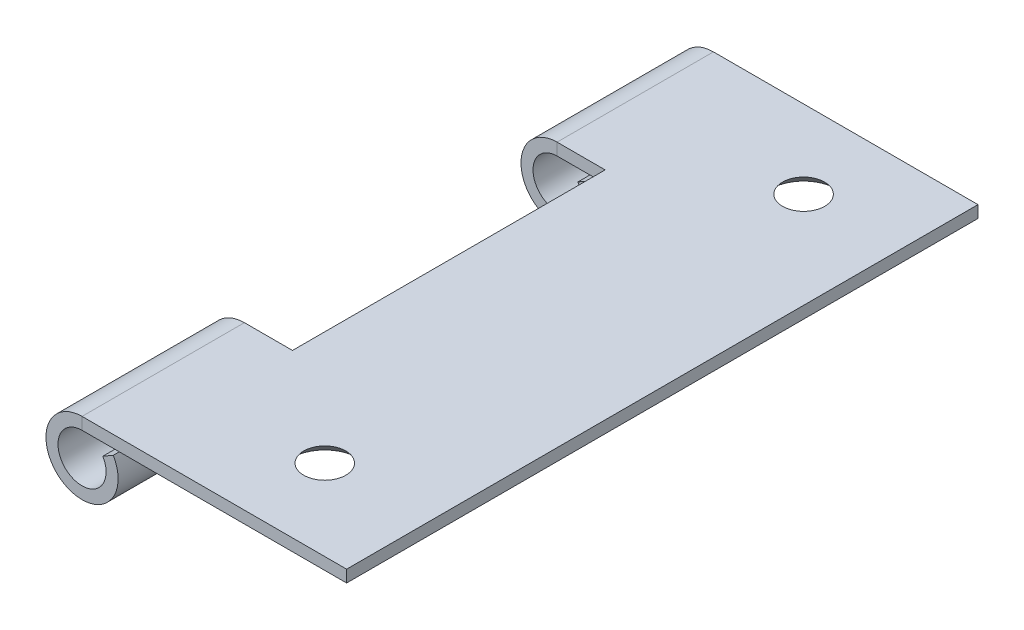
ISO-10303-21;
HEADER;
FILE_DESCRIPTION(('STEP AP214'),'2;1');
FILE_NAME('part.step','',(''),(''),'','','');
FILE_SCHEMA(('AUTOMOTIVE_DESIGN { 1 0 10303 214 1 1 1 1 }'));
ENDSEC;
DATA;
#1=APPLICATION_CONTEXT('core data for automotive mechanical design processes');
#2=APPLICATION_PROTOCOL_DEFINITION('international standard','automotive_design',2000,#1);
#3=PRODUCT_CONTEXT('',#1,'mechanical');
#4=PRODUCT('Part','Part','',(#3));
#5=PRODUCT_RELATED_PRODUCT_CATEGORY('part','',(#4));
#6=PRODUCT_DEFINITION_FORMATION('','',#4);
#7=PRODUCT_DEFINITION_CONTEXT('part definition',#1,'design');
#8=PRODUCT_DEFINITION('design','',#6,#7);
#9=PRODUCT_DEFINITION_SHAPE('','',#8);
#10=(LENGTH_UNIT() NAMED_UNIT(*) SI_UNIT(.MILLI.,.METRE.));
#11=(NAMED_UNIT(*) PLANE_ANGLE_UNIT() SI_UNIT($,.RADIAN.));
#12=(NAMED_UNIT(*) SI_UNIT($,.STERADIAN.) SOLID_ANGLE_UNIT());
#13=UNCERTAINTY_MEASURE_WITH_UNIT(LENGTH_MEASURE(1.E-05),#10,'distance_accuracy_value','');
#14=(GEOMETRIC_REPRESENTATION_CONTEXT(3) GLOBAL_UNCERTAINTY_ASSIGNED_CONTEXT((#13)) GLOBAL_UNIT_ASSIGNED_CONTEXT((#10,
#11,#12)) REPRESENTATION_CONTEXT('',''));
#15=CARTESIAN_POINT('',(0.,0.,0.));
#16=DIRECTION('',(0.,0.,1.));
#17=DIRECTION('',(1.,0.,0.));
#18=AXIS2_PLACEMENT_3D('',#15,#16,#17);
#19=CARTESIAN_POINT('',(19.,-1.,-0.272985055178714));
#20=DIRECTION('',(0.,0.,1.));
#21=DIRECTION('',(1.,0.,0.));
#22=AXIS2_PLACEMENT_3D('',#19,#20,#21);
#23=PLANE('',#22);
#24=DIRECTION('',(1.,0.,0.));
#25=VECTOR('',#24,1.);
#26=CARTESIAN_POINT('',(19.,0.,-0.272985055178714));
#27=LINE('',#26,#25);
#28=CARTESIAN_POINT('',(-3.,0.,-0.272985055178712));
#29=VERTEX_POINT('',#28);
#30=CARTESIAN_POINT('',(19.,0.,-0.272985055178714));
#31=VERTEX_POINT('',#30);
#32=EDGE_CURVE('E133',#29,#31,#27,.T.);
#33=ORIENTED_EDGE('',*,*,#32,.F.);
#34=DIRECTION('',(0.,1.,0.));
#35=VECTOR('',#34,1.);
#36=CARTESIAN_POINT('',(-3.,-1.,-0.272985055178711));
#37=LINE('',#36,#35);
#38=CARTESIAN_POINT('',(-3.,-1.,-0.272985055178711));
#39=VERTEX_POINT('',#38);
#40=EDGE_CURVE('E11',#39,#29,#37,.T.);
#41=ORIENTED_EDGE('',*,*,#40,.F.);
#42=DIRECTION('',(1.,0.,0.));
#43=VECTOR('',#42,1.);
#44=CARTESIAN_POINT('',(19.,-1.,-0.272985055178714));
#45=LINE('',#44,#43);
#46=CARTESIAN_POINT('',(19.,-1.,-0.272985055178714));
#47=VERTEX_POINT('',#46);
#48=EDGE_CURVE('E154',#39,#47,#45,.T.);
#49=ORIENTED_EDGE('',*,*,#48,.T.);
#50=DIRECTION('',(0.,1.,0.));
#51=VECTOR('',#50,1.);
#52=CARTESIAN_POINT('',(19.,-1.,-0.272985055178714));
#53=LINE('',#52,#51);
#54=EDGE_CURVE('E92',#47,#31,#53,.T.);
#55=ORIENTED_EDGE('',*,*,#54,.T.);
#56=EDGE_LOOP('',(#33,#41,#49,#55));
#57=FACE_BOUND('',#56,.T.);
#58=ADVANCED_FACE('F38',(#57),#23,.T.);
#59=CARTESIAN_POINT('',(1.00000000000001,-1.,-13.7729850551787));
#60=DIRECTION('',(0.,0.,-1.));
#61=DIRECTION('',(-1.,0.,0.));
#62=AXIS2_PLACEMENT_3D('',#59,#60,#61);
#63=PLANE('',#62);
#64=DIRECTION('',(-1.,0.,0.));
#65=VECTOR('',#64,1.);
#66=CARTESIAN_POINT('',(1.00000000000001,0.,-13.7729850551787));
#67=LINE('',#66,#65);
#68=CARTESIAN_POINT('',(1.00000000000001,0.,-13.7729850551787));
#69=VERTEX_POINT('',#68);
#70=CARTESIAN_POINT('',(-3.,0.,-13.7729850551787));
#71=VERTEX_POINT('',#70);
#72=EDGE_CURVE('E112',#69,#71,#67,.T.);
#73=ORIENTED_EDGE('',*,*,#72,.F.);
#74=DIRECTION('',(0.,1.,0.));
#75=VECTOR('',#74,1.);
#76=CARTESIAN_POINT('',(1.00000000000001,-1.,-13.7729850551787));
#77=LINE('',#76,#75);
#78=CARTESIAN_POINT('',(1.00000000000001,-1.,-13.7729850551787));
#79=VERTEX_POINT('',#78);
#80=EDGE_CURVE('E79',#79,#69,#77,.T.);
#81=ORIENTED_EDGE('',*,*,#80,.F.);
#82=DIRECTION('',(-1.,0.,0.));
#83=VECTOR('',#82,1.);
#84=CARTESIAN_POINT('',(1.00000000000001,-1.,-13.7729850551787));
#85=LINE('',#84,#83);
#86=CARTESIAN_POINT('',(-3.,-1.,-13.7729850551787));
#87=VERTEX_POINT('',#86);
#88=EDGE_CURVE('E110',#79,#87,#85,.T.);
#89=ORIENTED_EDGE('',*,*,#88,.T.);
#90=DIRECTION('',(0.,1.,0.));
#91=VECTOR('',#90,1.);
#92=CARTESIAN_POINT('',(-3.,-1.,-13.7729850551787));
#93=LINE('',#92,#91);
#94=EDGE_CURVE('E47',#87,#71,#93,.T.);
#95=ORIENTED_EDGE('',*,*,#94,.T.);
#96=EDGE_LOOP('',(#73,#81,#89,#95));
#97=FACE_BOUND('',#96,.T.);
#98=ADVANCED_FACE('F109',(#97),#63,.T.);
#99=CARTESIAN_POINT('',(1.,-1.,-39.7729850551787));
#100=DIRECTION('',(-1.,0.,0.));
#101=DIRECTION('',(0.,0.,1.));
#102=AXIS2_PLACEMENT_3D('',#99,#100,#101);
#103=PLANE('',#102);
#104=DIRECTION('',(0.,0.,1.));
#105=VECTOR('',#104,1.);
#106=CARTESIAN_POINT('',(1.,0.,-39.7729850551787));
#107=LINE('',#106,#105);
#108=CARTESIAN_POINT('',(1.,0.,-39.7729850551787));
#109=VERTEX_POINT('',#108);
#110=EDGE_CURVE('E149',#109,#69,#107,.T.);
#111=ORIENTED_EDGE('',*,*,#110,.F.);
#112=DIRECTION('',(0.,1.,0.));
#113=VECTOR('',#112,1.);
#114=CARTESIAN_POINT('',(1.,-1.,-39.7729850551787));
#115=LINE('',#114,#113);
#116=CARTESIAN_POINT('',(1.,-1.,-39.7729850551787));
#117=VERTEX_POINT('',#116);
#118=EDGE_CURVE('E114',#117,#109,#115,.T.);
#119=ORIENTED_EDGE('',*,*,#118,.F.);
#120=DIRECTION('',(0.,0.,1.));
#121=VECTOR('',#120,1.);
#122=CARTESIAN_POINT('',(1.,-1.,-39.7729850551787));
#123=LINE('',#122,#121);
#124=EDGE_CURVE('E120',#117,#79,#123,.T.);
#125=ORIENTED_EDGE('',*,*,#124,.T.);
#126=ORIENTED_EDGE('',*,*,#80,.T.);
#127=EDGE_LOOP('',(#111,#119,#125,#126));
#128=FACE_BOUND('',#127,.T.);
#129=ADVANCED_FACE('F125',(#128),#103,.T.);
#130=CARTESIAN_POINT('',(-3.,-1.,-39.7729850551787));
#131=DIRECTION('',(0.,0.,1.));
#132=DIRECTION('',(1.,0.,0.));
#133=AXIS2_PLACEMENT_3D('',#130,#131,#132);
#134=PLANE('',#133);
#135=DIRECTION('',(1.,0.,0.));
#136=VECTOR('',#135,1.);
#137=CARTESIAN_POINT('',(-3.,0.,-39.7729850551787));
#138=LINE('',#137,#136);
#139=CARTESIAN_POINT('',(-3.,0.,-39.7729850551787));
#140=VERTEX_POINT('',#139);
#141=EDGE_CURVE('E146',#140,#109,#138,.T.);
#142=ORIENTED_EDGE('',*,*,#141,.F.);
#143=DIRECTION('',(0.,1.,0.));
#144=VECTOR('',#143,1.);
#145=CARTESIAN_POINT('',(-3.,-1.,-39.7729850551787));
#146=LINE('',#145,#144);
#147=CARTESIAN_POINT('',(-3.,-1.,-39.7729850551787));
#148=VERTEX_POINT('',#147);
#149=EDGE_CURVE('E158',#148,#140,#146,.T.);
#150=ORIENTED_EDGE('',*,*,#149,.F.);
#151=DIRECTION('',(1.,0.,0.));
#152=VECTOR('',#151,1.);
#153=CARTESIAN_POINT('',(-3.,-1.,-39.7729850551787));
#154=LINE('',#153,#152);
#155=EDGE_CURVE('E126',#148,#117,#154,.T.);
#156=ORIENTED_EDGE('',*,*,#155,.T.);
#157=ORIENTED_EDGE('',*,*,#118,.T.);
#158=EDGE_LOOP('',(#142,#150,#156,#157));
#159=FACE_BOUND('',#158,.T.);
#160=ADVANCED_FACE('F311',(#159),#134,.T.);
#161=CARTESIAN_POINT('',(19.,-1.,-52.7729850551787));
#162=DIRECTION('',(0.,0.,-1.));
#163=DIRECTION('',(-1.,0.,0.));
#164=AXIS2_PLACEMENT_3D('',#161,#162,#163);
#165=PLANE('',#164);
#166=DIRECTION('',(-1.,0.,0.));
#167=VECTOR('',#166,1.);
#168=CARTESIAN_POINT('',(19.,0.,-52.7729850551787));
#169=LINE('',#168,#167);
#170=CARTESIAN_POINT('',(19.,0.,-52.7729850551787));
#171=VERTEX_POINT('',#170);
#172=CARTESIAN_POINT('',(-3.,0.,-52.7729850551787));
#173=VERTEX_POINT('',#172);
#174=EDGE_CURVE('E140',#171,#173,#169,.T.);
#175=ORIENTED_EDGE('',*,*,#174,.F.);
#176=DIRECTION('',(0.,1.,0.));
#177=VECTOR('',#176,1.);
#178=CARTESIAN_POINT('',(19.,-1.,-52.7729850551787));
#179=LINE('',#178,#177);
#180=CARTESIAN_POINT('',(19.,-1.,-52.7729850551787));
#181=VERTEX_POINT('',#180);
#182=EDGE_CURVE('E163',#181,#171,#179,.T.);
#183=ORIENTED_EDGE('',*,*,#182,.F.);
#184=DIRECTION('',(-1.,0.,0.));
#185=VECTOR('',#184,1.);
#186=CARTESIAN_POINT('',(19.,-1.,-52.7729850551787));
#187=LINE('',#186,#185);
#188=CARTESIAN_POINT('',(-3.,-1.,-52.7729850551787));
#189=VERTEX_POINT('',#188);
#190=EDGE_CURVE('E228',#181,#189,#187,.T.);
#191=ORIENTED_EDGE('',*,*,#190,.T.);
#192=DIRECTION('',(0.,1.,0.));
#193=VECTOR('',#192,1.);
#194=CARTESIAN_POINT('',(-3.,-1.,-52.7729850551787));
#195=LINE('',#194,#193);
#196=EDGE_CURVE('E161',#189,#173,#195,.T.);
#197=ORIENTED_EDGE('',*,*,#196,.T.);
#198=EDGE_LOOP('',(#175,#183,#191,#197));
#199=FACE_BOUND('',#198,.T.);
#200=ADVANCED_FACE('F255',(#199),#165,.T.);
#201=CARTESIAN_POINT('',(19.,-1.,-52.7729850551787));
#202=DIRECTION('',(1.,0.,0.));
#203=DIRECTION('',(0.,0.,-1.));
#204=AXIS2_PLACEMENT_3D('',#201,#202,#203);
#205=PLANE('',#204);
#206=DIRECTION('',(0.,0.,-1.));
#207=VECTOR('',#206,1.);
#208=CARTESIAN_POINT('',(19.,0.,-52.7729850551787));
#209=LINE('',#208,#207);
#210=EDGE_CURVE('E136',#31,#171,#209,.T.);
#211=ORIENTED_EDGE('',*,*,#210,.F.);
#212=ORIENTED_EDGE('',*,*,#54,.F.);
#213=DIRECTION('',(0.,0.,-1.));
#214=VECTOR('',#213,1.);
#215=CARTESIAN_POINT('',(19.,-1.,-52.7729850551787));
#216=LINE('',#215,#214);
#217=EDGE_CURVE('E226',#47,#181,#216,.T.);
#218=ORIENTED_EDGE('',*,*,#217,.T.);
#219=ORIENTED_EDGE('',*,*,#182,.T.);
#220=EDGE_LOOP('',(#211,#212,#218,#219));
#221=FACE_BOUND('',#220,.T.);
#222=ADVANCED_FACE('F320',(#221),#205,.T.);
#223=CARTESIAN_POINT('',(0.,-1.,0.));
#224=DIRECTION('',(0.,-1.,0.));
#225=DIRECTION('',(0.,0.,-1.));
#226=AXIS2_PLACEMENT_3D('',#223,#224,#225);
#227=PLANE('',#226);
#228=CARTESIAN_POINT('',(11.,-1.,-46.2729850551787));
#229=DIRECTION('',(0.,-1.,0.));
#230=DIRECTION('',(0.,0.,-1.));
#231=AXIS2_PLACEMENT_3D('',#228,#229,#230);
#232=CIRCLE('',#231,2.75);
#233=CARTESIAN_POINT('',(11.,-1.,-49.0229850551787));
#234=VERTEX_POINT('',#233);
#235=EDGE_CURVE('E179',#234,#234,#232,.T.);
#236=ORIENTED_EDGE('',*,*,#235,.F.);
#237=EDGE_LOOP('',(#236));
#238=FACE_BOUND('',#237,.T.);
#239=CARTESIAN_POINT('',(10.4545805207329,-1.,-7.00278254794632));
#240=DIRECTION('',(0.,-1.,0.));
#241=DIRECTION('',(0.,0.,-1.));
#242=AXIS2_PLACEMENT_3D('',#239,#240,#241);
#243=CIRCLE('',#242,2.75);
#244=CARTESIAN_POINT('',(10.4545805207329,-1.,-9.75278254794632));
#245=VERTEX_POINT('',#244);
#246=EDGE_CURVE('E168',#245,#245,#243,.T.);
#247=ORIENTED_EDGE('',*,*,#246,.F.);
#248=EDGE_LOOP('',(#247));
#249=FACE_BOUND('',#248,.T.);
#250=ORIENTED_EDGE('',*,*,#48,.F.);
#251=DIRECTION('',(0.,0.,1.));
#252=VECTOR('',#251,1.);
#253=CARTESIAN_POINT('',(-3.,-1.,-0.272985055178711));
#254=LINE('',#253,#252);
#255=EDGE_CURVE('E123',#87,#39,#254,.T.);
#256=ORIENTED_EDGE('',*,*,#255,.F.);
#257=ORIENTED_EDGE('',*,*,#88,.F.);
#258=ORIENTED_EDGE('',*,*,#124,.F.);
#259=ORIENTED_EDGE('',*,*,#155,.F.);
#260=DIRECTION('',(0.,0.,1.));
#261=VECTOR('',#260,1.);
#262=CARTESIAN_POINT('',(-3.,-1.,-39.7729850551787));
#263=LINE('',#262,#261);
#264=EDGE_CURVE('E128',#189,#148,#263,.T.);
#265=ORIENTED_EDGE('',*,*,#264,.F.);
#266=ORIENTED_EDGE('',*,*,#190,.F.);
#267=ORIENTED_EDGE('',*,*,#217,.F.);
#268=EDGE_LOOP('',(#250,#256,#257,#258,#259,#265,#266,#267));
#269=FACE_BOUND('',#268,.T.);
#270=ADVANCED_FACE('F118',(#238,#249,#269),#227,.T.);
#271=CARTESIAN_POINT('',(0.,0.,0.));
#272=DIRECTION('',(0.,-1.,0.));
#273=DIRECTION('',(0.,0.,-1.));
#274=AXIS2_PLACEMENT_3D('',#271,#272,#273);
#275=PLANE('',#274);
#276=CARTESIAN_POINT('',(11.,0.,-46.2729850551787));
#277=DIRECTION('',(0.,-1.,0.));
#278=DIRECTION('',(0.,0.,-1.));
#279=AXIS2_PLACEMENT_3D('',#276,#277,#278);
#280=CIRCLE('',#279,1.75);
#281=CARTESIAN_POINT('',(11.,0.,-48.0229850551787));
#282=VERTEX_POINT('',#281);
#283=EDGE_CURVE('E41',#282,#282,#280,.T.);
#284=ORIENTED_EDGE('',*,*,#283,.T.);
#285=EDGE_LOOP('',(#284));
#286=FACE_BOUND('',#285,.T.);
#287=CARTESIAN_POINT('',(10.4545805207329,0.,-7.00278254794632));
#288=DIRECTION('',(0.,-1.,0.));
#289=DIRECTION('',(0.,0.,-1.));
#290=AXIS2_PLACEMENT_3D('',#287,#288,#289);
#291=CIRCLE('',#290,1.75);
#292=CARTESIAN_POINT('',(10.4545805207329,0.,-8.75278254794632));
#293=VERTEX_POINT('',#292);
#294=EDGE_CURVE('E165',#293,#293,#291,.T.);
#295=ORIENTED_EDGE('',*,*,#294,.T.);
#296=EDGE_LOOP('',(#295));
#297=FACE_BOUND('',#296,.T.);
#298=ORIENTED_EDGE('',*,*,#32,.T.);
#299=ORIENTED_EDGE('',*,*,#210,.T.);
#300=ORIENTED_EDGE('',*,*,#174,.T.);
#301=DIRECTION('',(0.,0.,1.));
#302=VECTOR('',#301,1.);
#303=CARTESIAN_POINT('',(-3.,0.,-39.7729850551787));
#304=LINE('',#303,#302);
#305=EDGE_CURVE('E143',#173,#140,#304,.T.);
#306=ORIENTED_EDGE('',*,*,#305,.T.);
#307=ORIENTED_EDGE('',*,*,#141,.T.);
#308=ORIENTED_EDGE('',*,*,#110,.T.);
#309=ORIENTED_EDGE('',*,*,#72,.T.);
#310=DIRECTION('',(0.,0.,1.));
#311=VECTOR('',#310,1.);
#312=CARTESIAN_POINT('',(-3.,0.,-0.272985055178711));
#313=LINE('',#312,#311);
#314=EDGE_CURVE('E152',#71,#29,#313,.T.);
#315=ORIENTED_EDGE('',*,*,#314,.T.);
#316=EDGE_LOOP('',(#298,#299,#300,#306,#307,#308,#309,#315));
#317=FACE_BOUND('',#316,.T.);
#318=ADVANCED_FACE('F258',(#286,#297,#317),#275,.F.);
#319=CARTESIAN_POINT('',(-1.26794919243113,-1.99999999999998,-46.2729850551787));
#320=DIRECTION('',(0.50000000000001,-0.866025403784433,0.));
#321=DIRECTION('',(0.,0.,-1.));
#322=AXIS2_PLACEMENT_3D('',#319,#320,#321);
#323=PLANE('',#322);
#324=DIRECTION('',(0.866025403784433,0.50000000000001,0.));
#325=VECTOR('',#324,1.);
#326=CARTESIAN_POINT('',(-1.26794919243113,-1.99999999999998,-52.7729850551787));
#327=LINE('',#326,#325);
#328=CARTESIAN_POINT('',(-1.26794919243113,-1.99999999999998,-52.7729850551787));
#329=VERTEX_POINT('',#328);
#330=CARTESIAN_POINT('',(-0.401923788646698,-1.49999999999997,-52.7729850551787));
#331=VERTEX_POINT('',#330);
#332=EDGE_CURVE('E137',#329,#331,#327,.T.);
#333=ORIENTED_EDGE('',*,*,#332,.F.);
#334=DIRECTION('',(0.,0.,-1.));
#335=VECTOR('',#334,1.);
#336=CARTESIAN_POINT('',(-1.26794919243113,-1.99999999999998,-52.7729850551787));
#337=LINE('',#336,#335);
#338=CARTESIAN_POINT('',(-1.26794919243113,-1.99999999999998,-39.7729850551787));
#339=VERTEX_POINT('',#338);
#340=EDGE_CURVE('E202',#339,#329,#337,.T.);
#341=ORIENTED_EDGE('',*,*,#340,.F.);
#342=DIRECTION('',(0.866025403784433,0.50000000000001,0.));
#343=VECTOR('',#342,1.);
#344=CARTESIAN_POINT('',(-1.26794919243113,-1.99999999999998,-39.7729850551787));
#345=LINE('',#344,#343);
#346=CARTESIAN_POINT('',(-0.401923788646698,-1.49999999999997,-39.7729850551787));
#347=VERTEX_POINT('',#346);
#348=EDGE_CURVE('E206',#339,#347,#345,.T.);
#349=ORIENTED_EDGE('',*,*,#348,.T.);
#350=DIRECTION('',(0.,0.,-1.));
#351=VECTOR('',#350,1.);
#352=CARTESIAN_POINT('',(-0.401923788646698,-1.49999999999997,-52.7729850551787));
#353=LINE('',#352,#351);
#354=EDGE_CURVE('E208',#347,#331,#353,.T.);
#355=ORIENTED_EDGE('',*,*,#354,.T.);
#356=EDGE_LOOP('',(#333,#341,#349,#355));
#357=FACE_BOUND('',#356,.T.);
#358=ADVANCED_FACE('F247',(#357),#323,.F.);
#359=CARTESIAN_POINT('',(-3.,-3.,-39.7729850551787));
#360=DIRECTION('',(0.,0.,1.));
#361=DIRECTION('',(1.,0.,0.));
#362=AXIS2_PLACEMENT_3D('',#359,#360,#361);
#363=PLANE('',#362);
#364=ORIENTED_EDGE('',*,*,#348,.F.);
#365=CARTESIAN_POINT('',(-3.,-3.,-39.7729850551787));
#366=DIRECTION('',(0.,0.,-1.));
#367=DIRECTION('',(-1.,0.,0.));
#368=AXIS2_PLACEMENT_3D('',#365,#366,#367);
#369=CIRCLE('',#368,2.);
#370=EDGE_CURVE('E211',#148,#339,#369,.F.);
#371=ORIENTED_EDGE('',*,*,#370,.F.);
#372=ORIENTED_EDGE('',*,*,#149,.T.);
#373=CARTESIAN_POINT('',(-3.,-3.,-39.7729850551787));
#374=DIRECTION('',(0.,0.,-1.));
#375=DIRECTION('',(-1.,0.,0.));
#376=AXIS2_PLACEMENT_3D('',#373,#374,#375);
#377=CIRCLE('',#376,3.);
#378=EDGE_CURVE('E203',#140,#347,#377,.F.);
#379=ORIENTED_EDGE('',*,*,#378,.T.);
#380=EDGE_LOOP('',(#364,#371,#372,#379));
#381=FACE_BOUND('',#380,.T.);
#382=ADVANCED_FACE('F239',(#381),#363,.T.);
#383=CARTESIAN_POINT('',(-3.,-3.,-52.7729850551787));
#384=DIRECTION('',(0.,0.,1.));
#385=DIRECTION('',(1.,0.,0.));
#386=AXIS2_PLACEMENT_3D('',#383,#384,#385);
#387=PLANE('',#386);
#388=CARTESIAN_POINT('',(-3.,-3.,-52.7729850551787));
#389=DIRECTION('',(0.,0.,-1.));
#390=DIRECTION('',(-1.,0.,0.));
#391=AXIS2_PLACEMENT_3D('',#388,#389,#390);
#392=CIRCLE('',#391,2.);
#393=EDGE_CURVE('E216',#329,#189,#392,.T.);
#394=ORIENTED_EDGE('',*,*,#393,.F.);
#395=ORIENTED_EDGE('',*,*,#332,.T.);
#396=CARTESIAN_POINT('',(-3.,-3.,-52.7729850551787));
#397=DIRECTION('',(0.,0.,-1.));
#398=DIRECTION('',(-1.,0.,0.));
#399=AXIS2_PLACEMENT_3D('',#396,#397,#398);
#400=CIRCLE('',#399,3.);
#401=EDGE_CURVE('E207',#331,#173,#400,.T.);
#402=ORIENTED_EDGE('',*,*,#401,.T.);
#403=ORIENTED_EDGE('',*,*,#196,.F.);
#404=EDGE_LOOP('',(#394,#395,#402,#403));
#405=FACE_BOUND('',#404,.T.);
#406=ADVANCED_FACE('F250',(#405),#387,.F.);
#407=CARTESIAN_POINT('',(-3.,-3.,-52.7729850551787));
#408=DIRECTION('',(0.,0.,-1.));
#409=DIRECTION('',(0.866025403784433,0.50000000000001,0.));
#410=AXIS2_PLACEMENT_3D('',#407,#408,#409);
#411=CYLINDRICAL_SURFACE('',#410,3.);
#412=ORIENTED_EDGE('',*,*,#305,.F.);
#413=ORIENTED_EDGE('',*,*,#401,.F.);
#414=ORIENTED_EDGE('',*,*,#354,.F.);
#415=ORIENTED_EDGE('',*,*,#378,.F.);
#416=EDGE_LOOP('',(#412,#413,#414,#415));
#417=FACE_BOUND('',#416,.T.);
#418=ADVANCED_FACE('F261',(#417),#411,.T.);
#419=CARTESIAN_POINT('',(-3.,-3.,-52.7729850551787));
#420=DIRECTION('',(0.,0.,-1.));
#421=DIRECTION('',(0.866025403784433,0.50000000000001,0.));
#422=AXIS2_PLACEMENT_3D('',#419,#420,#421);
#423=CYLINDRICAL_SURFACE('',#422,2.);
#424=ORIENTED_EDGE('',*,*,#264,.T.);
#425=ORIENTED_EDGE('',*,*,#370,.T.);
#426=ORIENTED_EDGE('',*,*,#340,.T.);
#427=ORIENTED_EDGE('',*,*,#393,.T.);
#428=EDGE_LOOP('',(#424,#425,#426,#427));
#429=FACE_BOUND('',#428,.T.);
#430=ADVANCED_FACE('F233',(#429),#423,.F.);
#431=CARTESIAN_POINT('',(-1.26794919243113,-1.99999999999998,-7.02298505517871));
#432=DIRECTION('',(0.50000000000001,-0.866025403784433,0.));
#433=DIRECTION('',(0.,0.,-1.));
#434=AXIS2_PLACEMENT_3D('',#431,#432,#433);
#435=PLANE('',#434);
#436=DIRECTION('',(0.866025403784433,0.50000000000001,0.));
#437=VECTOR('',#436,1.);
#438=CARTESIAN_POINT('',(-1.26794919243113,-1.99999999999998,-13.7729850551787));
#439=LINE('',#438,#437);
#440=CARTESIAN_POINT('',(-1.26794919243113,-1.99999999999998,-13.7729850551787));
#441=VERTEX_POINT('',#440);
#442=CARTESIAN_POINT('',(-0.401923788646698,-1.49999999999997,-13.7729850551787));
#443=VERTEX_POINT('',#442);
#444=EDGE_CURVE('E199',#441,#443,#439,.T.);
#445=ORIENTED_EDGE('',*,*,#444,.F.);
#446=DIRECTION('',(0.,0.,-1.));
#447=VECTOR('',#446,1.);
#448=CARTESIAN_POINT('',(-1.26794919243113,-1.99999999999998,-13.7729850551787));
#449=LINE('',#448,#447);
#450=CARTESIAN_POINT('',(-1.26794919243113,-1.99999999999998,-0.272985055178712));
#451=VERTEX_POINT('',#450);
#452=EDGE_CURVE('E167',#451,#441,#449,.T.);
#453=ORIENTED_EDGE('',*,*,#452,.F.);
#454=DIRECTION('',(0.866025403784433,0.50000000000001,0.));
#455=VECTOR('',#454,1.);
#456=CARTESIAN_POINT('',(-1.26794919243113,-1.99999999999998,-0.272985055178712));
#457=LINE('',#456,#455);
#458=CARTESIAN_POINT('',(-0.401923788646698,-1.49999999999997,-0.272985055178712));
#459=VERTEX_POINT('',#458);
#460=EDGE_CURVE('E185',#451,#459,#457,.T.);
#461=ORIENTED_EDGE('',*,*,#460,.T.);
#462=DIRECTION('',(0.,0.,-1.));
#463=VECTOR('',#462,1.);
#464=CARTESIAN_POINT('',(-0.401923788646698,-1.49999999999997,-13.7729850551787));
#465=LINE('',#464,#463);
#466=EDGE_CURVE('E187',#459,#443,#465,.T.);
#467=ORIENTED_EDGE('',*,*,#466,.T.);
#468=EDGE_LOOP('',(#445,#453,#461,#467));
#469=FACE_BOUND('',#468,.T.);
#470=ADVANCED_FACE('F286',(#469),#435,.F.);
#471=CARTESIAN_POINT('',(-3.,-3.,-0.272985055178712));
#472=DIRECTION('',(0.,0.,1.));
#473=DIRECTION('',(1.,0.,0.));
#474=AXIS2_PLACEMENT_3D('',#471,#472,#473);
#475=PLANE('',#474);
#476=ORIENTED_EDGE('',*,*,#460,.F.);
#477=CARTESIAN_POINT('',(-3.,-3.,-0.272985055178712));
#478=DIRECTION('',(0.,0.,-1.));
#479=DIRECTION('',(-1.,0.,0.));
#480=AXIS2_PLACEMENT_3D('',#477,#478,#479);
#481=CIRCLE('',#480,2.);
#482=EDGE_CURVE('E190',#39,#451,#481,.F.);
#483=ORIENTED_EDGE('',*,*,#482,.F.);
#484=ORIENTED_EDGE('',*,*,#40,.T.);
#485=CARTESIAN_POINT('',(-3.,-3.,-0.272985055178712));
#486=DIRECTION('',(0.,0.,-1.));
#487=DIRECTION('',(-1.,0.,0.));
#488=AXIS2_PLACEMENT_3D('',#485,#486,#487);
#489=CIRCLE('',#488,3.);
#490=EDGE_CURVE('E182',#29,#459,#489,.F.);
#491=ORIENTED_EDGE('',*,*,#490,.T.);
#492=EDGE_LOOP('',(#476,#483,#484,#491));
#493=FACE_BOUND('',#492,.T.);
#494=ADVANCED_FACE('F282',(#493),#475,.T.);
#495=CARTESIAN_POINT('',(-3.,-3.,-13.7729850551787));
#496=DIRECTION('',(0.,0.,1.));
#497=DIRECTION('',(1.,0.,0.));
#498=AXIS2_PLACEMENT_3D('',#495,#496,#497);
#499=PLANE('',#498);
#500=CARTESIAN_POINT('',(-3.,-3.,-13.7729850551787));
#501=DIRECTION('',(0.,0.,-1.));
#502=DIRECTION('',(-1.,0.,0.));
#503=AXIS2_PLACEMENT_3D('',#500,#501,#502);
#504=CIRCLE('',#503,2.);
#505=EDGE_CURVE('E172',#441,#87,#504,.T.);
#506=ORIENTED_EDGE('',*,*,#505,.F.);
#507=ORIENTED_EDGE('',*,*,#444,.T.);
#508=CARTESIAN_POINT('',(-3.,-3.,-13.7729850551787));
#509=DIRECTION('',(0.,0.,-1.));
#510=DIRECTION('',(-1.,0.,0.));
#511=AXIS2_PLACEMENT_3D('',#508,#509,#510);
#512=CIRCLE('',#511,3.);
#513=EDGE_CURVE('E186',#443,#71,#512,.T.);
#514=ORIENTED_EDGE('',*,*,#513,.T.);
#515=ORIENTED_EDGE('',*,*,#94,.F.);
#516=EDGE_LOOP('',(#506,#507,#514,#515));
#517=FACE_BOUND('',#516,.T.);
#518=ADVANCED_FACE('F292',(#517),#499,.F.);
#519=CARTESIAN_POINT('',(-3.,-3.,-13.7729850551787));
#520=DIRECTION('',(0.,0.,-1.));
#521=DIRECTION('',(0.866025403784433,0.50000000000001,0.));
#522=AXIS2_PLACEMENT_3D('',#519,#520,#521);
#523=CYLINDRICAL_SURFACE('',#522,3.);
#524=ORIENTED_EDGE('',*,*,#314,.F.);
#525=ORIENTED_EDGE('',*,*,#513,.F.);
#526=ORIENTED_EDGE('',*,*,#466,.F.);
#527=ORIENTED_EDGE('',*,*,#490,.F.);
#528=EDGE_LOOP('',(#524,#525,#526,#527));
#529=FACE_BOUND('',#528,.T.);
#530=ADVANCED_FACE('F284',(#529),#523,.T.);
#531=CARTESIAN_POINT('',(-3.,-3.,-13.7729850551787));
#532=DIRECTION('',(0.,0.,-1.));
#533=DIRECTION('',(0.866025403784433,0.50000000000001,0.));
#534=AXIS2_PLACEMENT_3D('',#531,#532,#533);
#535=CYLINDRICAL_SURFACE('',#534,2.);
#536=ORIENTED_EDGE('',*,*,#255,.T.);
#537=ORIENTED_EDGE('',*,*,#482,.T.);
#538=ORIENTED_EDGE('',*,*,#452,.T.);
#539=ORIENTED_EDGE('',*,*,#505,.T.);
#540=EDGE_LOOP('',(#536,#537,#538,#539));
#541=FACE_BOUND('',#540,.T.);
#542=ADVANCED_FACE('F290',(#541),#535,.F.);
#543=CARTESIAN_POINT('',(10.4545805207329,-1.,-7.00278254794632));
#544=DIRECTION('',(0.,-1.,0.));
#545=DIRECTION('',(0.,0.,-1.));
#546=AXIS2_PLACEMENT_3D('',#543,#544,#545);
#547=CONICAL_SURFACE('',#546,2.75,0.785398163397449);
#548=ORIENTED_EDGE('',*,*,#246,.T.);
#549=EDGE_LOOP('',(#548));
#550=FACE_BOUND('',#549,.T.);
#551=ORIENTED_EDGE('',*,*,#294,.F.);
#552=EDGE_LOOP('',(#551));
#553=FACE_BOUND('',#552,.T.);
#554=ADVANCED_FACE('F379',(#550,#553),#547,.F.);
#555=CARTESIAN_POINT('',(11.,-1.,-46.2729850551787));
#556=DIRECTION('',(0.,-1.,0.));
#557=DIRECTION('',(0.,0.,-1.));
#558=AXIS2_PLACEMENT_3D('',#555,#556,#557);
#559=CONICAL_SURFACE('',#558,2.75,0.785398163397449);
#560=ORIENTED_EDGE('',*,*,#235,.T.);
#561=EDGE_LOOP('',(#560));
#562=FACE_BOUND('',#561,.T.);
#563=ORIENTED_EDGE('',*,*,#283,.F.);
#564=EDGE_LOOP('',(#563));
#565=FACE_BOUND('',#564,.T.);
#566=ADVANCED_FACE('F404',(#562,#565),#559,.F.);
#567=CLOSED_SHELL('',(#58,#98,#129,#160,#200,#222,#270,#318,#358,#382,#406,#418,#430,#470,#494,
#518,#530,#542,#554,#566));
#568=MANIFOLD_SOLID_BREP('B2',#567);
#569=ADVANCED_BREP_SHAPE_REPRESENTATION('',(#18,#568),#14);
#570=SHAPE_DEFINITION_REPRESENTATION(#9,#569);
ENDSEC;
END-ISO-10303-21;
